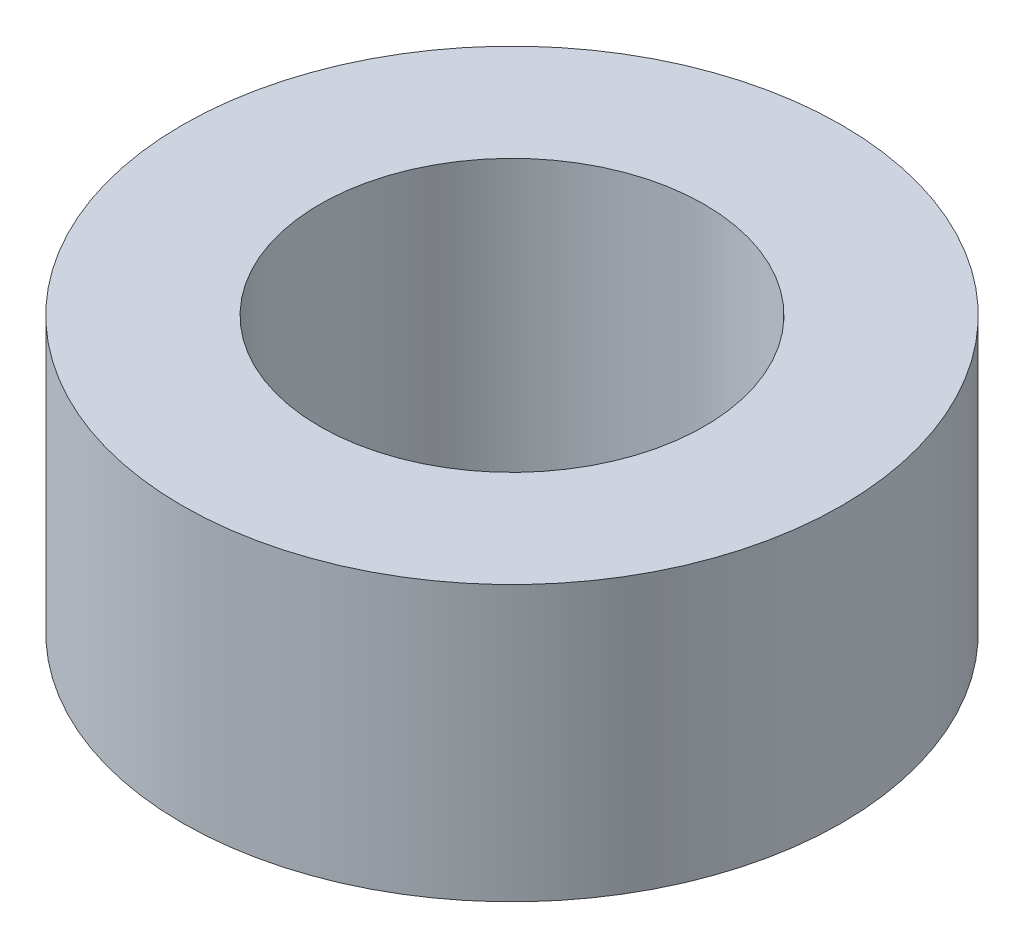
ISO-10303-21;
HEADER;
FILE_DESCRIPTION(('STEP AP214'),'2;1');
FILE_NAME('part.step','',(''),(''),'','','');
FILE_SCHEMA(('AUTOMOTIVE_DESIGN { 1 0 10303 214 1 1 1 1 }'));
ENDSEC;
DATA;
#1=APPLICATION_CONTEXT('core data for automotive mechanical design processes');
#2=APPLICATION_PROTOCOL_DEFINITION('international standard','automotive_design',2000,#1);
#3=PRODUCT_CONTEXT('',#1,'mechanical');
#4=PRODUCT('Part','Part','',(#3));
#5=PRODUCT_RELATED_PRODUCT_CATEGORY('part','',(#4));
#6=PRODUCT_DEFINITION_FORMATION('','',#4);
#7=PRODUCT_DEFINITION_CONTEXT('part definition',#1,'design');
#8=PRODUCT_DEFINITION('design','',#6,#7);
#9=PRODUCT_DEFINITION_SHAPE('','',#8);
#10=(LENGTH_UNIT() NAMED_UNIT(*) SI_UNIT(.MILLI.,.METRE.));
#11=(NAMED_UNIT(*) PLANE_ANGLE_UNIT() SI_UNIT($,.RADIAN.));
#12=(NAMED_UNIT(*) SI_UNIT($,.STERADIAN.) SOLID_ANGLE_UNIT());
#13=UNCERTAINTY_MEASURE_WITH_UNIT(LENGTH_MEASURE(1.E-05),#10,'distance_accuracy_value','');
#14=(GEOMETRIC_REPRESENTATION_CONTEXT(3) GLOBAL_UNCERTAINTY_ASSIGNED_CONTEXT((#13)) GLOBAL_UNIT_ASSIGNED_CONTEXT((#10,
#11,#12)) REPRESENTATION_CONTEXT('',''));
#15=CARTESIAN_POINT('',(0.,0.,0.));
#16=DIRECTION('',(0.,0.,1.));
#17=DIRECTION('',(1.,0.,0.));
#18=AXIS2_PLACEMENT_3D('',#15,#16,#17);
#19=CARTESIAN_POINT('',(0.,10.,0.));
#20=DIRECTION('',(0.,1.,0.));
#21=DIRECTION('',(0.,0.,1.));
#22=AXIS2_PLACEMENT_3D('',#19,#20,#21);
#23=PLANE('',#22);
#24=CARTESIAN_POINT('',(0.,10.,0.));
#25=DIRECTION('',(0.,1.,0.));
#26=DIRECTION('',(0.,0.,1.));
#27=AXIS2_PLACEMENT_3D('',#24,#25,#26);
#28=CIRCLE('',#27,12.);
#29=CARTESIAN_POINT('',(0.,10.,12.));
#30=VERTEX_POINT('',#29);
#31=EDGE_CURVE('E10',#30,#30,#28,.T.);
#32=ORIENTED_EDGE('',*,*,#31,.T.);
#33=EDGE_LOOP('',(#32));
#34=FACE_BOUND('',#33,.T.);
#35=CARTESIAN_POINT('',(0.,10.,0.));
#36=DIRECTION('',(0.,1.,0.));
#37=DIRECTION('',(0.,0.,1.));
#38=AXIS2_PLACEMENT_3D('',#35,#36,#37);
#39=CIRCLE('',#38,7.);
#40=CARTESIAN_POINT('',(0.,10.,7.));
#41=VERTEX_POINT('',#40);
#42=EDGE_CURVE('E50',#41,#41,#39,.T.);
#43=ORIENTED_EDGE('',*,*,#42,.F.);
#44=EDGE_LOOP('',(#43));
#45=FACE_BOUND('',#44,.T.);
#46=ADVANCED_FACE('F37',(#34,#45),#23,.T.);
#47=CARTESIAN_POINT('',(0.,0.,0.));
#48=DIRECTION('',(0.,1.,0.));
#49=DIRECTION('',(0.,0.,1.));
#50=AXIS2_PLACEMENT_3D('',#47,#48,#49);
#51=PLANE('',#50);
#52=CARTESIAN_POINT('',(0.,0.,0.));
#53=DIRECTION('',(0.,1.,0.));
#54=DIRECTION('',(0.,0.,1.));
#55=AXIS2_PLACEMENT_3D('',#52,#53,#54);
#56=CIRCLE('',#55,12.);
#57=CARTESIAN_POINT('',(0.,0.,12.));
#58=VERTEX_POINT('',#57);
#59=EDGE_CURVE('E41',#58,#58,#56,.T.);
#60=ORIENTED_EDGE('',*,*,#59,.F.);
#61=EDGE_LOOP('',(#60));
#62=FACE_BOUND('',#61,.T.);
#63=CARTESIAN_POINT('',(0.,0.,0.));
#64=DIRECTION('',(0.,1.,0.));
#65=DIRECTION('',(0.,0.,1.));
#66=AXIS2_PLACEMENT_3D('',#63,#64,#65);
#67=CIRCLE('',#66,7.);
#68=CARTESIAN_POINT('',(0.,0.,7.));
#69=VERTEX_POINT('',#68);
#70=EDGE_CURVE('E52',#69,#69,#67,.T.);
#71=ORIENTED_EDGE('',*,*,#70,.T.);
#72=EDGE_LOOP('',(#71));
#73=FACE_BOUND('',#72,.T.);
#74=ADVANCED_FACE('F64',(#62,#73),#51,.F.);
#75=CARTESIAN_POINT('',(0.,10.,0.));
#76=DIRECTION('',(0.,-1.,0.));
#77=DIRECTION('',(0.,0.,-1.));
#78=AXIS2_PLACEMENT_3D('',#75,#76,#77);
#79=CYLINDRICAL_SURFACE('',#78,12.);
#80=ORIENTED_EDGE('',*,*,#31,.F.);
#81=EDGE_LOOP('',(#80));
#82=FACE_BOUND('',#81,.T.);
#83=ORIENTED_EDGE('',*,*,#59,.T.);
#84=EDGE_LOOP('',(#83));
#85=FACE_BOUND('',#84,.T.);
#86=ADVANCED_FACE('F39',(#82,#85),#79,.T.);
#87=CARTESIAN_POINT('',(0.,10.,0.));
#88=DIRECTION('',(0.,-1.,0.));
#89=DIRECTION('',(0.,0.,-1.));
#90=AXIS2_PLACEMENT_3D('',#87,#88,#89);
#91=CYLINDRICAL_SURFACE('',#90,7.);
#92=ORIENTED_EDGE('',*,*,#42,.T.);
#93=EDGE_LOOP('',(#92));
#94=FACE_BOUND('',#93,.T.);
#95=ORIENTED_EDGE('',*,*,#70,.F.);
#96=EDGE_LOOP('',(#95));
#97=FACE_BOUND('',#96,.T.);
#98=ADVANCED_FACE('F60',(#94,#97),#91,.F.);
#99=CLOSED_SHELL('',(#46,#74,#86,#98));
#100=MANIFOLD_SOLID_BREP('B2',#99);
#101=ADVANCED_BREP_SHAPE_REPRESENTATION('',(#18,#100),#14);
#102=SHAPE_DEFINITION_REPRESENTATION(#9,#101);
ENDSEC;
END-ISO-10303-21;
